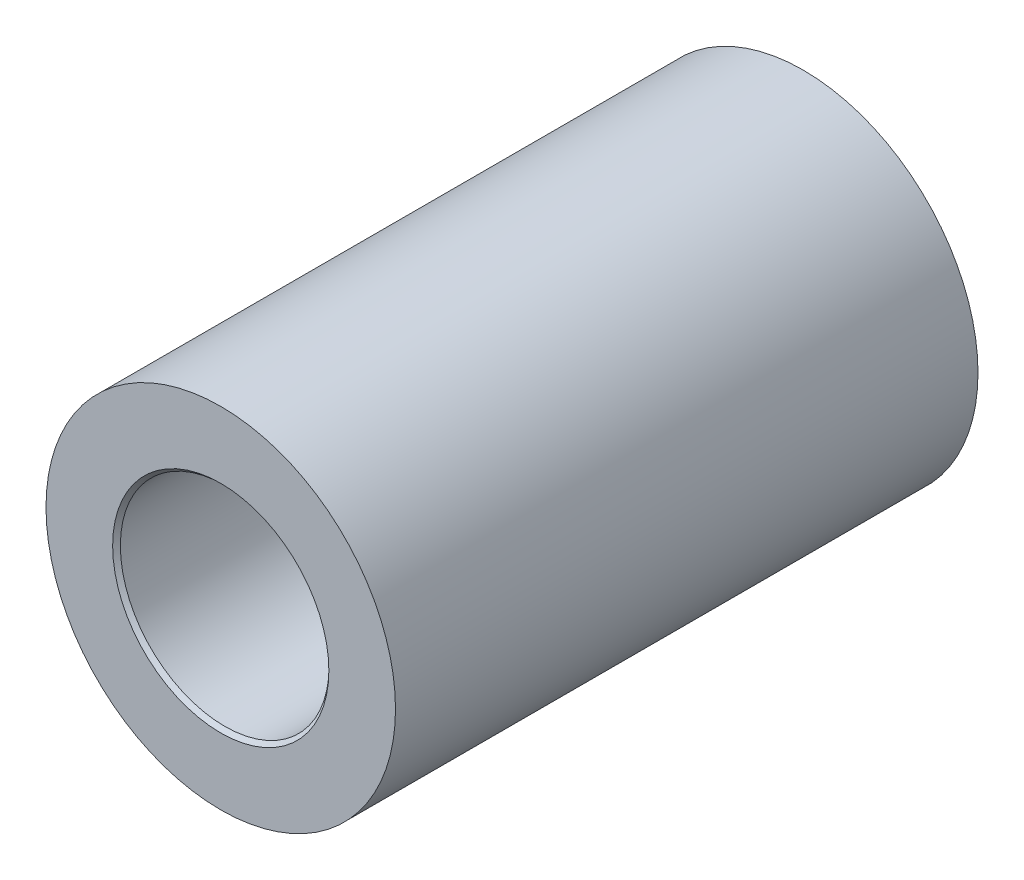
ISO-10303-21;
HEADER;
FILE_DESCRIPTION(('STEP AP214'),'2;1');
FILE_NAME('part.step','',(''),(''),'','','');
FILE_SCHEMA(('AUTOMOTIVE_DESIGN { 1 0 10303 214 1 1 1 1 }'));
ENDSEC;
DATA;
#1=APPLICATION_CONTEXT('core data for automotive mechanical design processes');
#2=APPLICATION_PROTOCOL_DEFINITION('international standard','automotive_design',2000,#1);
#3=PRODUCT_CONTEXT('',#1,'mechanical');
#4=PRODUCT('Part','Part','',(#3));
#5=PRODUCT_RELATED_PRODUCT_CATEGORY('part','',(#4));
#6=PRODUCT_DEFINITION_FORMATION('','',#4);
#7=PRODUCT_DEFINITION_CONTEXT('part definition',#1,'design');
#8=PRODUCT_DEFINITION('design','',#6,#7);
#9=PRODUCT_DEFINITION_SHAPE('','',#8);
#10=(LENGTH_UNIT() NAMED_UNIT(*) SI_UNIT(.MILLI.,.METRE.));
#11=(NAMED_UNIT(*) PLANE_ANGLE_UNIT() SI_UNIT($,.RADIAN.));
#12=(NAMED_UNIT(*) SI_UNIT($,.STERADIAN.) SOLID_ANGLE_UNIT());
#13=UNCERTAINTY_MEASURE_WITH_UNIT(LENGTH_MEASURE(1.E-05),#10,'distance_accuracy_value','');
#14=(GEOMETRIC_REPRESENTATION_CONTEXT(3) GLOBAL_UNCERTAINTY_ASSIGNED_CONTEXT((#13)) GLOBAL_UNIT_ASSIGNED_CONTEXT((#10,
#11,#12)) REPRESENTATION_CONTEXT('',''));
#15=CARTESIAN_POINT('',(0.,0.,0.));
#16=DIRECTION('',(0.,0.,1.));
#17=DIRECTION('',(1.,0.,0.));
#18=AXIS2_PLACEMENT_3D('',#15,#16,#17);
#19=CARTESIAN_POINT('',(0.,0.,3.96875));
#20=DIRECTION('',(0.,0.,1.));
#21=DIRECTION('',(1.,0.,0.));
#22=AXIS2_PLACEMENT_3D('',#19,#20,#21);
#23=PLANE('',#22);
#24=CARTESIAN_POINT('',(0.,0.,3.96875));
#25=DIRECTION('',(0.,0.,-1.));
#26=DIRECTION('',(-1.,0.,0.));
#27=AXIS2_PLACEMENT_3D('',#24,#25,#26);
#28=CIRCLE('',#27,1.4732);
#29=CARTESIAN_POINT('',(-1.4732,0.,3.96875));
#30=VERTEX_POINT('',#29);
#31=EDGE_CURVE('E43',#30,#30,#28,.T.);
#32=ORIENTED_EDGE('',*,*,#31,.T.);
#33=EDGE_LOOP('',(#32));
#34=FACE_BOUND('',#33,.T.);
#35=CARTESIAN_POINT('',(0.,0.,3.96875));
#36=DIRECTION('',(0.,0.,1.));
#37=DIRECTION('',(1.,0.,0.));
#38=AXIS2_PLACEMENT_3D('',#35,#36,#37);
#39=CIRCLE('',#38,2.38125);
#40=CARTESIAN_POINT('',(2.38125,0.,3.96875));
#41=VERTEX_POINT('',#40);
#42=EDGE_CURVE('E47',#41,#41,#39,.T.);
#43=ORIENTED_EDGE('',*,*,#42,.T.);
#44=EDGE_LOOP('',(#43));
#45=FACE_BOUND('',#44,.T.);
#46=ADVANCED_FACE('F30',(#34,#45),#23,.T.);
#47=CARTESIAN_POINT('',(0.,0.,-3.96875));
#48=DIRECTION('',(0.,0.,1.));
#49=DIRECTION('',(1.,0.,0.));
#50=AXIS2_PLACEMENT_3D('',#47,#48,#49);
#51=PLANE('',#50);
#52=CARTESIAN_POINT('',(0.,0.,-3.96875));
#53=DIRECTION('',(0.,0.,-1.));
#54=DIRECTION('',(-1.,0.,0.));
#55=AXIS2_PLACEMENT_3D('',#52,#53,#54);
#56=CIRCLE('',#55,1.4732);
#57=CARTESIAN_POINT('',(-1.4732,0.,-3.96875));
#58=VERTEX_POINT('',#57);
#59=EDGE_CURVE('E37',#58,#58,#56,.T.);
#60=ORIENTED_EDGE('',*,*,#59,.F.);
#61=EDGE_LOOP('',(#60));
#62=FACE_BOUND('',#61,.T.);
#63=CARTESIAN_POINT('',(0.,0.,-3.96875));
#64=DIRECTION('',(0.,0.,1.));
#65=DIRECTION('',(1.,0.,0.));
#66=AXIS2_PLACEMENT_3D('',#63,#64,#65);
#67=CIRCLE('',#66,2.38125);
#68=CARTESIAN_POINT('',(2.38125,0.,-3.96875));
#69=VERTEX_POINT('',#68);
#70=EDGE_CURVE('E46',#69,#69,#67,.T.);
#71=ORIENTED_EDGE('',*,*,#70,.F.);
#72=EDGE_LOOP('',(#71));
#73=FACE_BOUND('',#72,.T.);
#74=ADVANCED_FACE('F56',(#62,#73),#51,.F.);
#75=CARTESIAN_POINT('',(0.,0.,3.96875));
#76=DIRECTION('',(0.,0.,-1.));
#77=DIRECTION('',(-1.,0.,0.));
#78=AXIS2_PLACEMENT_3D('',#75,#76,#77);
#79=CYLINDRICAL_SURFACE('',#78,1.4224);
#80=CARTESIAN_POINT('',(0.,0.,-3.91427366953075));
#81=DIRECTION('',(0.,0.,-1.));
#82=DIRECTION('',(-1.,0.,0.));
#83=AXIS2_PLACEMENT_3D('',#80,#81,#82);
#84=CIRCLE('',#83,1.4224);
#85=CARTESIAN_POINT('',(-1.4224,0.,-3.91427366953075));
#86=VERTEX_POINT('',#85);
#87=EDGE_CURVE('E11',#86,#86,#84,.F.);
#88=ORIENTED_EDGE('',*,*,#87,.F.);
#89=EDGE_LOOP('',(#88));
#90=FACE_BOUND('',#89,.T.);
#91=CARTESIAN_POINT('',(0.,0.,3.91427366953075));
#92=DIRECTION('',(0.,0.,1.));
#93=DIRECTION('',(1.,0.,0.));
#94=AXIS2_PLACEMENT_3D('',#91,#92,#93);
#95=CIRCLE('',#94,1.4224);
#96=CARTESIAN_POINT('',(1.4224,0.,3.91427366953075));
#97=VERTEX_POINT('',#96);
#98=EDGE_CURVE('E33',#97,#97,#95,.T.);
#99=ORIENTED_EDGE('',*,*,#98,.T.);
#100=EDGE_LOOP('',(#99));
#101=FACE_BOUND('',#100,.T.);
#102=ADVANCED_FACE('F58',(#90,#101),#79,.F.);
#103=CARTESIAN_POINT('',(0.,0.,-3.96875));
#104=DIRECTION('',(0.,0.,-1.));
#105=DIRECTION('',(-1.,0.,0.));
#106=AXIS2_PLACEMENT_3D('',#103,#104,#105);
#107=CONICAL_SURFACE('',#106,1.4732,0.750491578357563);
#108=ORIENTED_EDGE('',*,*,#87,.T.);
#109=EDGE_LOOP('',(#108));
#110=FACE_BOUND('',#109,.T.);
#111=ORIENTED_EDGE('',*,*,#59,.T.);
#112=EDGE_LOOP('',(#111));
#113=FACE_BOUND('',#112,.T.);
#114=ADVANCED_FACE('F65',(#110,#113),#107,.F.);
#115=CARTESIAN_POINT('',(0.,0.,3.96875));
#116=DIRECTION('',(0.,0.,1.));
#117=DIRECTION('',(-1.,0.,0.));
#118=AXIS2_PLACEMENT_3D('',#115,#116,#117);
#119=CONICAL_SURFACE('',#118,1.4732,0.750491578357563);
#120=ORIENTED_EDGE('',*,*,#98,.F.);
#121=EDGE_LOOP('',(#120));
#122=FACE_BOUND('',#121,.T.);
#123=ORIENTED_EDGE('',*,*,#31,.F.);
#124=EDGE_LOOP('',(#123));
#125=FACE_BOUND('',#124,.T.);
#126=ADVANCED_FACE('F72',(#122,#125),#119,.F.);
#127=CARTESIAN_POINT('',(0.,0.,-3.96875));
#128=DIRECTION('',(0.,0.,1.));
#129=DIRECTION('',(1.,0.,0.));
#130=AXIS2_PLACEMENT_3D('',#127,#128,#129);
#131=CYLINDRICAL_SURFACE('',#130,2.38125);
#132=ORIENTED_EDGE('',*,*,#70,.T.);
#133=EDGE_LOOP('',(#132));
#134=FACE_BOUND('',#133,.T.);
#135=ORIENTED_EDGE('',*,*,#42,.F.);
#136=EDGE_LOOP('',(#135));
#137=FACE_BOUND('',#136,.T.);
#138=ADVANCED_FACE('F53',(#134,#137),#131,.T.);
#139=CLOSED_SHELL('',(#46,#74,#102,#114,#126,#138));
#140=MANIFOLD_SOLID_BREP('B2',#139);
#141=ADVANCED_BREP_SHAPE_REPRESENTATION('',(#18,#140),#14);
#142=SHAPE_DEFINITION_REPRESENTATION(#9,#141);
ENDSEC;
END-ISO-10303-21;
